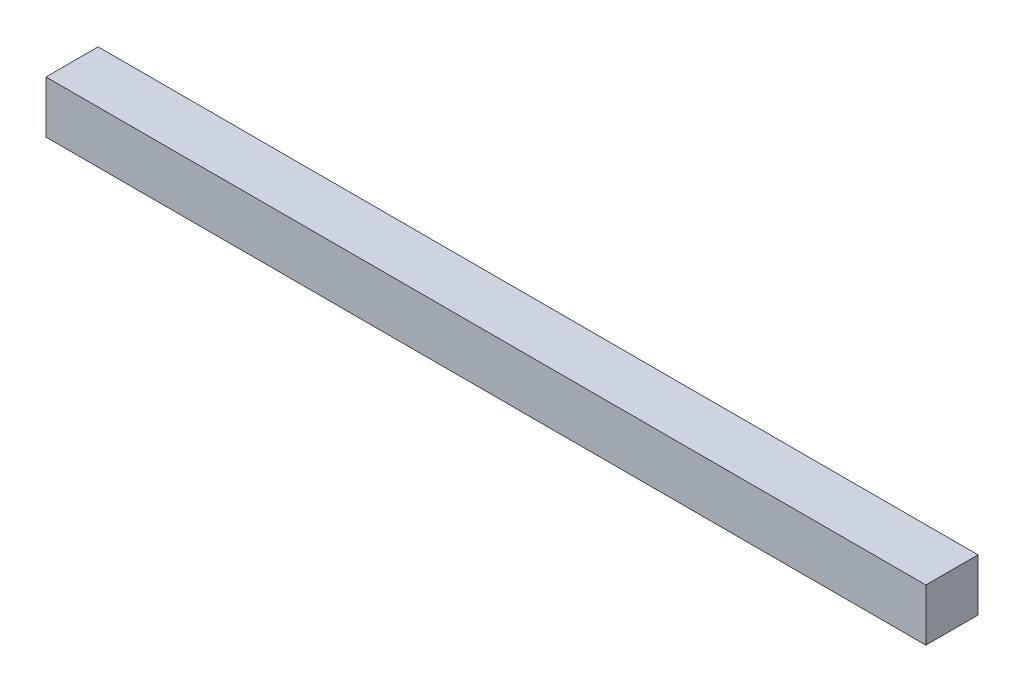
ISO-10303-21;
HEADER;
FILE_DESCRIPTION(('STEP AP214'),'2;1');
FILE_NAME('part.step','',(''),(''),'','','');
FILE_SCHEMA(('AUTOMOTIVE_DESIGN { 1 0 10303 214 1 1 1 1 }'));
ENDSEC;
DATA;
#1=APPLICATION_CONTEXT('core data for automotive mechanical design processes');
#2=APPLICATION_PROTOCOL_DEFINITION('international standard','automotive_design',2000,#1);
#3=PRODUCT_CONTEXT('',#1,'mechanical');
#4=PRODUCT('Part','Part','',(#3));
#5=PRODUCT_RELATED_PRODUCT_CATEGORY('part','',(#4));
#6=PRODUCT_DEFINITION_FORMATION('','',#4);
#7=PRODUCT_DEFINITION_CONTEXT('part definition',#1,'design');
#8=PRODUCT_DEFINITION('design','',#6,#7);
#9=PRODUCT_DEFINITION_SHAPE('','',#8);
#10=(LENGTH_UNIT() NAMED_UNIT(*) SI_UNIT(.MILLI.,.METRE.));
#11=(NAMED_UNIT(*) PLANE_ANGLE_UNIT() SI_UNIT($,.RADIAN.));
#12=(NAMED_UNIT(*) SI_UNIT($,.STERADIAN.) SOLID_ANGLE_UNIT());
#13=UNCERTAINTY_MEASURE_WITH_UNIT(LENGTH_MEASURE(1.E-05),#10,'distance_accuracy_value','');
#14=(GEOMETRIC_REPRESENTATION_CONTEXT(3) GLOBAL_UNCERTAINTY_ASSIGNED_CONTEXT((#13)) GLOBAL_UNIT_ASSIGNED_CONTEXT((#10,
#11,#12)) REPRESENTATION_CONTEXT('',''));
#15=CARTESIAN_POINT('',(0.,0.,0.));
#16=DIRECTION('',(0.,0.,1.));
#17=DIRECTION('',(1.,0.,0.));
#18=AXIS2_PLACEMENT_3D('',#15,#16,#17);
#19=CARTESIAN_POINT('',(10.8,-0.32,-0.32));
#20=DIRECTION('',(0.,0.,1.));
#21=DIRECTION('',(1.,0.,0.));
#22=AXIS2_PLACEMENT_3D('',#19,#20,#21);
#23=PLANE('',#22);
#24=DIRECTION('',(0.,1.,0.));
#25=VECTOR('',#24,1.);
#26=CARTESIAN_POINT('',(0.,-0.32,-0.32));
#27=LINE('',#26,#25);
#28=CARTESIAN_POINT('',(0.,-0.32,-0.32));
#29=VERTEX_POINT('',#28);
#30=CARTESIAN_POINT('',(0.,0.32,-0.32));
#31=VERTEX_POINT('',#30);
#32=EDGE_CURVE('E107',#29,#31,#27,.T.);
#33=ORIENTED_EDGE('',*,*,#32,.T.);
#34=DIRECTION('',(-1.,0.,0.));
#35=VECTOR('',#34,1.);
#36=CARTESIAN_POINT('',(10.8,0.32,-0.32));
#37=LINE('',#36,#35);
#38=CARTESIAN_POINT('',(10.8,0.32,-0.32));
#39=VERTEX_POINT('',#38);
#40=EDGE_CURVE('E11',#39,#31,#37,.T.);
#41=ORIENTED_EDGE('',*,*,#40,.F.);
#42=DIRECTION('',(0.,1.,0.));
#43=VECTOR('',#42,1.);
#44=CARTESIAN_POINT('',(10.8,-0.32,-0.32));
#45=LINE('',#44,#43);
#46=CARTESIAN_POINT('',(10.8,-0.32,-0.32));
#47=VERTEX_POINT('',#46);
#48=EDGE_CURVE('E91',#47,#39,#45,.T.);
#49=ORIENTED_EDGE('',*,*,#48,.F.);
#50=DIRECTION('',(-1.,0.,0.));
#51=VECTOR('',#50,1.);
#52=CARTESIAN_POINT('',(10.8,-0.32,-0.32));
#53=LINE('',#52,#51);
#54=EDGE_CURVE('E103',#47,#29,#53,.T.);
#55=ORIENTED_EDGE('',*,*,#54,.T.);
#56=EDGE_LOOP('',(#33,#41,#49,#55));
#57=FACE_BOUND('',#56,.T.);
#58=ADVANCED_FACE('F39',(#57),#23,.F.);
#59=CARTESIAN_POINT('',(10.8,0.32,0.32));
#60=DIRECTION('',(0.,-1.,0.));
#61=DIRECTION('',(0.,0.,-1.));
#62=AXIS2_PLACEMENT_3D('',#59,#60,#61);
#63=PLANE('',#62);
#64=DIRECTION('',(0.,0.,1.));
#65=VECTOR('',#64,1.);
#66=CARTESIAN_POINT('',(0.,0.32,0.32));
#67=LINE('',#66,#65);
#68=CARTESIAN_POINT('',(0.,0.32,0.32));
#69=VERTEX_POINT('',#68);
#70=EDGE_CURVE('E96',#31,#69,#67,.T.);
#71=ORIENTED_EDGE('',*,*,#70,.T.);
#72=DIRECTION('',(-1.,0.,0.));
#73=VECTOR('',#72,1.);
#74=CARTESIAN_POINT('',(10.8,0.32,0.32));
#75=LINE('',#74,#73);
#76=CARTESIAN_POINT('',(10.8,0.32,0.32));
#77=VERTEX_POINT('',#76);
#78=EDGE_CURVE('E48',#77,#69,#75,.T.);
#79=ORIENTED_EDGE('',*,*,#78,.F.);
#80=DIRECTION('',(0.,0.,1.));
#81=VECTOR('',#80,1.);
#82=CARTESIAN_POINT('',(10.8,0.32,0.32));
#83=LINE('',#82,#81);
#84=EDGE_CURVE('E86',#39,#77,#83,.T.);
#85=ORIENTED_EDGE('',*,*,#84,.F.);
#86=ORIENTED_EDGE('',*,*,#40,.T.);
#87=EDGE_LOOP('',(#71,#79,#85,#86));
#88=FACE_BOUND('',#87,.T.);
#89=ADVANCED_FACE('F95',(#88),#63,.F.);
#90=CARTESIAN_POINT('',(10.8,-0.32,0.32));
#91=DIRECTION('',(0.,0.,-1.));
#92=DIRECTION('',(-1.,0.,0.));
#93=AXIS2_PLACEMENT_3D('',#90,#91,#92);
#94=PLANE('',#93);
#95=DIRECTION('',(0.,-1.,0.));
#96=VECTOR('',#95,1.);
#97=CARTESIAN_POINT('',(0.,-0.32,0.32));
#98=LINE('',#97,#96);
#99=CARTESIAN_POINT('',(0.,-0.32,0.32));
#100=VERTEX_POINT('',#99);
#101=EDGE_CURVE('E73',#69,#100,#98,.T.);
#102=ORIENTED_EDGE('',*,*,#101,.T.);
#103=DIRECTION('',(-1.,0.,0.));
#104=VECTOR('',#103,1.);
#105=CARTESIAN_POINT('',(10.8,-0.32,0.32));
#106=LINE('',#105,#104);
#107=CARTESIAN_POINT('',(10.8,-0.32,0.32));
#108=VERTEX_POINT('',#107);
#109=EDGE_CURVE('E98',#108,#100,#106,.T.);
#110=ORIENTED_EDGE('',*,*,#109,.F.);
#111=DIRECTION('',(0.,-1.,0.));
#112=VECTOR('',#111,1.);
#113=CARTESIAN_POINT('',(10.8,-0.32,0.32));
#114=LINE('',#113,#112);
#115=EDGE_CURVE('E89',#77,#108,#114,.T.);
#116=ORIENTED_EDGE('',*,*,#115,.F.);
#117=ORIENTED_EDGE('',*,*,#78,.T.);
#118=EDGE_LOOP('',(#102,#110,#116,#117));
#119=FACE_BOUND('',#118,.T.);
#120=ADVANCED_FACE('F99',(#119),#94,.F.);
#121=CARTESIAN_POINT('',(10.8,-0.32,0.32));
#122=DIRECTION('',(0.,1.,0.));
#123=DIRECTION('',(0.,0.,1.));
#124=AXIS2_PLACEMENT_3D('',#121,#122,#123);
#125=PLANE('',#124);
#126=DIRECTION('',(0.,0.,-1.));
#127=VECTOR('',#126,1.);
#128=CARTESIAN_POINT('',(0.,-0.32,0.32));
#129=LINE('',#128,#127);
#130=EDGE_CURVE('E79',#100,#29,#129,.T.);
#131=ORIENTED_EDGE('',*,*,#130,.T.);
#132=ORIENTED_EDGE('',*,*,#54,.F.);
#133=DIRECTION('',(0.,0.,-1.));
#134=VECTOR('',#133,1.);
#135=CARTESIAN_POINT('',(10.8,-0.32,0.32));
#136=LINE('',#135,#134);
#137=EDGE_CURVE('E56',#108,#47,#136,.T.);
#138=ORIENTED_EDGE('',*,*,#137,.F.);
#139=ORIENTED_EDGE('',*,*,#109,.T.);
#140=EDGE_LOOP('',(#131,#132,#138,#139));
#141=FACE_BOUND('',#140,.T.);
#142=ADVANCED_FACE('F120',(#141),#125,.F.);
#143=CARTESIAN_POINT('',(10.8,0.,0.));
#144=DIRECTION('',(-1.,0.,0.));
#145=DIRECTION('',(0.,0.,1.));
#146=AXIS2_PLACEMENT_3D('',#143,#144,#145);
#147=PLANE('',#146);
#148=ORIENTED_EDGE('',*,*,#48,.T.);
#149=ORIENTED_EDGE('',*,*,#84,.T.);
#150=ORIENTED_EDGE('',*,*,#115,.T.);
#151=ORIENTED_EDGE('',*,*,#137,.T.);
#152=EDGE_LOOP('',(#148,#149,#150,#151));
#153=FACE_BOUND('',#152,.T.);
#154=ADVANCED_FACE('F87',(#153),#147,.F.);
#155=CARTESIAN_POINT('',(0.,0.,0.));
#156=DIRECTION('',(-1.,0.,0.));
#157=DIRECTION('',(0.,0.,1.));
#158=AXIS2_PLACEMENT_3D('',#155,#156,#157);
#159=PLANE('',#158);
#160=ORIENTED_EDGE('',*,*,#32,.F.);
#161=ORIENTED_EDGE('',*,*,#130,.F.);
#162=ORIENTED_EDGE('',*,*,#101,.F.);
#163=ORIENTED_EDGE('',*,*,#70,.F.);
#164=EDGE_LOOP('',(#160,#161,#162,#163));
#165=FACE_BOUND('',#164,.T.);
#166=ADVANCED_FACE('F123',(#165),#159,.T.);
#167=CLOSED_SHELL('',(#58,#89,#120,#142,#154,#166));
#168=MANIFOLD_SOLID_BREP('B2',#167);
#169=ADVANCED_BREP_SHAPE_REPRESENTATION('',(#18,#168),#14);
#170=SHAPE_DEFINITION_REPRESENTATION(#9,#169);
ENDSEC;
END-ISO-10303-21;
